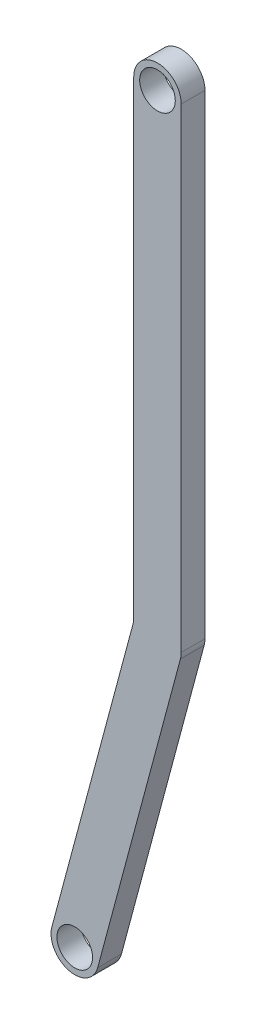
ISO-10303-21;
HEADER;
FILE_DESCRIPTION(('STEP AP214'),'2;1');
FILE_NAME('part.step','',(''),(''),'','','');
FILE_SCHEMA(('AUTOMOTIVE_DESIGN { 1 0 10303 214 1 1 1 1 }'));
ENDSEC;
DATA;
#1=APPLICATION_CONTEXT('core data for automotive mechanical design processes');
#2=APPLICATION_PROTOCOL_DEFINITION('international standard','automotive_design',2000,#1);
#3=PRODUCT_CONTEXT('',#1,'mechanical');
#4=PRODUCT('Part','Part','',(#3));
#5=PRODUCT_RELATED_PRODUCT_CATEGORY('part','',(#4));
#6=PRODUCT_DEFINITION_FORMATION('','',#4);
#7=PRODUCT_DEFINITION_CONTEXT('part definition',#1,'design');
#8=PRODUCT_DEFINITION('design','',#6,#7);
#9=PRODUCT_DEFINITION_SHAPE('','',#8);
#10=(LENGTH_UNIT() NAMED_UNIT(*) SI_UNIT(.MILLI.,.METRE.));
#11=(NAMED_UNIT(*) PLANE_ANGLE_UNIT() SI_UNIT($,.RADIAN.));
#12=(NAMED_UNIT(*) SI_UNIT($,.STERADIAN.) SOLID_ANGLE_UNIT());
#13=UNCERTAINTY_MEASURE_WITH_UNIT(LENGTH_MEASURE(1.E-05),#10,'distance_accuracy_value','');
#14=(GEOMETRIC_REPRESENTATION_CONTEXT(3) GLOBAL_UNCERTAINTY_ASSIGNED_CONTEXT((#13)) GLOBAL_UNIT_ASSIGNED_CONTEXT((#10,
#11,#12)) REPRESENTATION_CONTEXT('',''));
#15=CARTESIAN_POINT('',(0.,0.,0.));
#16=DIRECTION('',(0.,0.,1.));
#17=DIRECTION('',(1.,0.,0.));
#18=AXIS2_PLACEMENT_3D('',#15,#16,#17);
#19=CARTESIAN_POINT('',(5.96592582628884,-1.59856500725799,1.));
#20=DIRECTION('',(0.965925826289072,-0.258819045102508,0.));
#21=DIRECTION('',(0.258819045102508,0.965925826289072,0.));
#22=AXIS2_PLACEMENT_3D('',#19,#20,#21);
#23=PLANE('',#22);
#24=DIRECTION('',(-0.258819045102508,-0.965925826289072,0.));
#25=VECTOR('',#24,1.);
#26=CARTESIAN_POINT('',(5.96592582628884,-1.59856500725799,0.));
#27=LINE('',#26,#25);
#28=CARTESIAN_POINT('',(0.965925826289076,-20.2588190451025,0.));
#29=VERTEX_POINT('',#28);
#30=CARTESIAN_POINT('',(-2.51741367531533,-33.2588190451025,0.));
#31=VERTEX_POINT('',#30);
#32=EDGE_CURVE('E131',#29,#31,#27,.T.);
#33=ORIENTED_EDGE('',*,*,#32,.F.);
#34=DIRECTION('',(0.,0.,-1.));
#35=VECTOR('',#34,1.);
#36=CARTESIAN_POINT('',(0.965925826289076,-20.2588190451025,1.));
#37=LINE('',#36,#35);
#38=CARTESIAN_POINT('',(0.965925826289076,-20.2588190451025,1.));
#39=VERTEX_POINT('',#38);
#40=EDGE_CURVE('E11',#39,#29,#37,.T.);
#41=ORIENTED_EDGE('',*,*,#40,.F.);
#42=DIRECTION('',(-0.258819045102508,-0.965925826289072,0.));
#43=VECTOR('',#42,1.);
#44=CARTESIAN_POINT('',(5.96592582628884,-1.59856500725799,1.));
#45=LINE('',#44,#43);
#46=CARTESIAN_POINT('',(-2.51741367531533,-33.2588190451025,1.));
#47=VERTEX_POINT('',#46);
#48=EDGE_CURVE('E152',#39,#47,#45,.T.);
#49=ORIENTED_EDGE('',*,*,#48,.T.);
#50=DIRECTION('',(0.,0.,-1.));
#51=VECTOR('',#50,1.);
#52=CARTESIAN_POINT('',(-2.51741367531533,-33.2588190451025,1.));
#53=LINE('',#52,#51);
#54=EDGE_CURVE('E84',#47,#31,#53,.T.);
#55=ORIENTED_EDGE('',*,*,#54,.T.);
#56=EDGE_LOOP('',(#33,#41,#49,#55));
#57=FACE_BOUND('',#56,.T.);
#58=ADVANCED_FACE('F36',(#57),#23,.T.);
#59=CARTESIAN_POINT('',(0.,-20.,1.));
#60=DIRECTION('',(0.,0.,-1.));
#61=DIRECTION('',(-1.,0.,0.));
#62=AXIS2_PLACEMENT_3D('',#59,#60,#61);
#63=CYLINDRICAL_SURFACE('',#62,1.);
#64=CARTESIAN_POINT('',(0.,-20.,0.));
#65=DIRECTION('',(0.,0.,1.));
#66=DIRECTION('',(1.,0.,0.));
#67=AXIS2_PLACEMENT_3D('',#64,#65,#66);
#68=CIRCLE('',#67,1.);
#69=CARTESIAN_POINT('',(1.,-20.,0.));
#70=VERTEX_POINT('',#69);
#71=EDGE_CURVE('E134',#29,#70,#68,.T.);
#72=ORIENTED_EDGE('',*,*,#71,.T.);
#73=DIRECTION('',(0.,0.,-1.));
#74=VECTOR('',#73,1.);
#75=CARTESIAN_POINT('',(1.,-20.,1.));
#76=LINE('',#75,#74);
#77=CARTESIAN_POINT('',(1.,-20.,1.));
#78=VERTEX_POINT('',#77);
#79=EDGE_CURVE('E44',#78,#70,#76,.T.);
#80=ORIENTED_EDGE('',*,*,#79,.F.);
#81=CARTESIAN_POINT('',(0.,-20.,1.));
#82=DIRECTION('',(0.,0.,1.));
#83=DIRECTION('',(1.,0.,0.));
#84=AXIS2_PLACEMENT_3D('',#81,#82,#83);
#85=CIRCLE('',#84,1.);
#86=EDGE_CURVE('E172',#39,#78,#85,.T.);
#87=ORIENTED_EDGE('',*,*,#86,.F.);
#88=ORIENTED_EDGE('',*,*,#40,.T.);
#89=EDGE_LOOP('',(#72,#80,#87,#88));
#90=FACE_BOUND('',#89,.T.);
#91=ADVANCED_FACE('F165',(#90),#63,.T.);
#92=CARTESIAN_POINT('',(1.,0.,1.));
#93=DIRECTION('',(1.,0.,0.));
#94=DIRECTION('',(0.,1.,0.));
#95=AXIS2_PLACEMENT_3D('',#92,#93,#94);
#96=PLANE('',#95);
#97=DIRECTION('',(0.,-1.,0.));
#98=VECTOR('',#97,1.);
#99=CARTESIAN_POINT('',(1.,0.,0.));
#100=LINE('',#99,#98);
#101=CARTESIAN_POINT('',(1.,0.,0.));
#102=VERTEX_POINT('',#101);
#103=EDGE_CURVE('E137',#102,#70,#100,.T.);
#104=ORIENTED_EDGE('',*,*,#103,.F.);
#105=DIRECTION('',(0.,0.,-1.));
#106=VECTOR('',#105,1.);
#107=CARTESIAN_POINT('',(1.,0.,1.));
#108=LINE('',#107,#106);
#109=CARTESIAN_POINT('',(1.,0.,1.));
#110=VERTEX_POINT('',#109);
#111=EDGE_CURVE('E156',#110,#102,#108,.T.);
#112=ORIENTED_EDGE('',*,*,#111,.F.);
#113=DIRECTION('',(0.,-1.,0.));
#114=VECTOR('',#113,1.);
#115=CARTESIAN_POINT('',(1.,0.,1.));
#116=LINE('',#115,#114);
#117=EDGE_CURVE('E162',#110,#78,#116,.T.);
#118=ORIENTED_EDGE('',*,*,#117,.T.);
#119=ORIENTED_EDGE('',*,*,#79,.T.);
#120=EDGE_LOOP('',(#104,#112,#118,#119));
#121=FACE_BOUND('',#120,.T.);
#122=ADVANCED_FACE('F161',(#121),#96,.T.);
#123=CARTESIAN_POINT('',(0.,0.,1.));
#124=DIRECTION('',(0.,0.,-1.));
#125=DIRECTION('',(-1.,0.,0.));
#126=AXIS2_PLACEMENT_3D('',#123,#124,#125);
#127=CYLINDRICAL_SURFACE('',#126,1.);
#128=CARTESIAN_POINT('',(0.,0.,0.));
#129=DIRECTION('',(0.,0.,1.));
#130=DIRECTION('',(1.,0.,0.));
#131=AXIS2_PLACEMENT_3D('',#128,#129,#130);
#132=CIRCLE('',#131,1.);
#133=CARTESIAN_POINT('',(-1.,0.,0.));
#134=VERTEX_POINT('',#133);
#135=EDGE_CURVE('E140',#102,#134,#132,.T.);
#136=ORIENTED_EDGE('',*,*,#135,.T.);
#137=DIRECTION('',(0.,0.,-1.));
#138=VECTOR('',#137,1.);
#139=CARTESIAN_POINT('',(-1.,0.,1.));
#140=LINE('',#139,#138);
#141=CARTESIAN_POINT('',(-1.,0.,1.));
#142=VERTEX_POINT('',#141);
#143=EDGE_CURVE('E117',#142,#134,#140,.T.);
#144=ORIENTED_EDGE('',*,*,#143,.F.);
#145=CARTESIAN_POINT('',(0.,0.,1.));
#146=DIRECTION('',(0.,0.,1.));
#147=DIRECTION('',(1.,0.,0.));
#148=AXIS2_PLACEMENT_3D('',#145,#146,#147);
#149=CIRCLE('',#148,1.);
#150=EDGE_CURVE('E108',#110,#142,#149,.T.);
#151=ORIENTED_EDGE('',*,*,#150,.F.);
#152=ORIENTED_EDGE('',*,*,#111,.T.);
#153=EDGE_LOOP('',(#136,#144,#151,#152));
#154=FACE_BOUND('',#153,.T.);
#155=ADVANCED_FACE('F171',(#154),#127,.T.);
#156=CARTESIAN_POINT('',(-1.,0.,1.));
#157=DIRECTION('',(1.,0.,0.));
#158=DIRECTION('',(0.,1.,0.));
#159=AXIS2_PLACEMENT_3D('',#156,#157,#158);
#160=PLANE('',#159);
#161=DIRECTION('',(0.,-1.,0.));
#162=VECTOR('',#161,1.);
#163=CARTESIAN_POINT('',(-1.,0.,0.));
#164=LINE('',#163,#162);
#165=CARTESIAN_POINT('',(-0.999999999999998,-19.8683475024126,0.));
#166=VERTEX_POINT('',#165);
#167=EDGE_CURVE('E116',#134,#166,#164,.T.);
#168=ORIENTED_EDGE('',*,*,#167,.T.);
#169=DIRECTION('',(0.,0.,-1.));
#170=VECTOR('',#169,1.);
#171=CARTESIAN_POINT('',(-0.999999999999998,-19.8683475024126,1.));
#172=LINE('',#171,#170);
#173=CARTESIAN_POINT('',(-0.999999999999998,-19.8683475024126,1.));
#174=VERTEX_POINT('',#173);
#175=EDGE_CURVE('E113',#174,#166,#172,.T.);
#176=ORIENTED_EDGE('',*,*,#175,.F.);
#177=DIRECTION('',(0.,-1.,0.));
#178=VECTOR('',#177,1.);
#179=CARTESIAN_POINT('',(-1.,0.,1.));
#180=LINE('',#179,#178);
#181=EDGE_CURVE('E100',#142,#174,#180,.T.);
#182=ORIENTED_EDGE('',*,*,#181,.F.);
#183=ORIENTED_EDGE('',*,*,#143,.T.);
#184=EDGE_LOOP('',(#168,#176,#182,#183));
#185=FACE_BOUND('',#184,.T.);
#186=ADVANCED_FACE('F114',(#185),#160,.F.);
#187=CARTESIAN_POINT('',(4.03407417371069,-1.08092691705297,1.));
#188=DIRECTION('',(0.965925826289072,-0.258819045102507,0.));
#189=DIRECTION('',(0.258819045102507,0.965925826289072,0.));
#190=AXIS2_PLACEMENT_3D('',#187,#188,#189);
#191=PLANE('',#190);
#192=DIRECTION('',(-0.258819045102507,-0.965925826289072,0.));
#193=VECTOR('',#192,1.);
#194=CARTESIAN_POINT('',(4.03407417371069,-1.08092691705297,0.));
#195=LINE('',#194,#193);
#196=CARTESIAN_POINT('',(-4.44926532789347,-32.7411809548975,0.));
#197=VERTEX_POINT('',#196);
#198=EDGE_CURVE('E77',#166,#197,#195,.T.);
#199=ORIENTED_EDGE('',*,*,#198,.T.);
#200=DIRECTION('',(0.,0.,-1.));
#201=VECTOR('',#200,1.);
#202=CARTESIAN_POINT('',(-4.44926532789347,-32.7411809548975,1.));
#203=LINE('',#202,#201);
#204=CARTESIAN_POINT('',(-4.44926532789347,-32.7411809548975,1.));
#205=VERTEX_POINT('',#204);
#206=EDGE_CURVE('E118',#205,#197,#203,.T.);
#207=ORIENTED_EDGE('',*,*,#206,.F.);
#208=DIRECTION('',(-0.258819045102507,-0.965925826289072,0.));
#209=VECTOR('',#208,1.);
#210=CARTESIAN_POINT('',(4.03407417371069,-1.08092691705297,1.));
#211=LINE('',#210,#209);
#212=EDGE_CURVE('E105',#174,#205,#211,.T.);
#213=ORIENTED_EDGE('',*,*,#212,.F.);
#214=ORIENTED_EDGE('',*,*,#175,.T.);
#215=EDGE_LOOP('',(#199,#207,#213,#214));
#216=FACE_BOUND('',#215,.T.);
#217=ADVANCED_FACE('F120',(#216),#191,.F.);
#218=CARTESIAN_POINT('',(-3.4833395016044,-33.,1.));
#219=DIRECTION('',(0.,0.,-1.));
#220=DIRECTION('',(-1.,0.,0.));
#221=AXIS2_PLACEMENT_3D('',#218,#219,#220);
#222=CYLINDRICAL_SURFACE('',#221,0.750000000000001);
#223=CARTESIAN_POINT('',(-3.4833395016044,-33.,1.));
#224=DIRECTION('',(0.,0.,1.));
#225=DIRECTION('',(1.,0.,0.));
#226=AXIS2_PLACEMENT_3D('',#223,#224,#225);
#227=CIRCLE('',#226,0.750000000000001);
#228=CARTESIAN_POINT('',(-2.7333395016044,-33.,1.));
#229=VERTEX_POINT('',#228);
#230=EDGE_CURVE('E122',#229,#229,#227,.T.);
#231=ORIENTED_EDGE('',*,*,#230,.T.);
#232=EDGE_LOOP('',(#231));
#233=FACE_BOUND('',#232,.T.);
#234=CARTESIAN_POINT('',(-3.4833395016044,-33.,0.));
#235=DIRECTION('',(0.,0.,1.));
#236=DIRECTION('',(1.,0.,0.));
#237=AXIS2_PLACEMENT_3D('',#234,#235,#236);
#238=CIRCLE('',#237,0.750000000000001);
#239=CARTESIAN_POINT('',(-2.7333395016044,-33.,0.));
#240=VERTEX_POINT('',#239);
#241=EDGE_CURVE('E146',#240,#240,#238,.T.);
#242=ORIENTED_EDGE('',*,*,#241,.F.);
#243=EDGE_LOOP('',(#242));
#244=FACE_BOUND('',#243,.T.);
#245=ADVANCED_FACE('F191',(#233,#244),#222,.F.);
#246=CARTESIAN_POINT('',(-3.4833395016044,-33.,1.));
#247=DIRECTION('',(0.,0.,-1.));
#248=DIRECTION('',(-1.,0.,0.));
#249=AXIS2_PLACEMENT_3D('',#246,#247,#248);
#250=CYLINDRICAL_SURFACE('',#249,0.999999999999998);
#251=CARTESIAN_POINT('',(-3.4833395016044,-33.,0.));
#252=DIRECTION('',(0.,0.,1.));
#253=DIRECTION('',(1.,0.,0.));
#254=AXIS2_PLACEMENT_3D('',#251,#252,#253);
#255=CIRCLE('',#254,0.999999999999998);
#256=EDGE_CURVE('E144',#197,#31,#255,.T.);
#257=ORIENTED_EDGE('',*,*,#256,.T.);
#258=ORIENTED_EDGE('',*,*,#54,.F.);
#259=CARTESIAN_POINT('',(-3.4833395016044,-33.,1.));
#260=DIRECTION('',(0.,0.,1.));
#261=DIRECTION('',(1.,0.,0.));
#262=AXIS2_PLACEMENT_3D('',#259,#260,#261);
#263=CIRCLE('',#262,0.999999999999998);
#264=EDGE_CURVE('E52',#205,#47,#263,.T.);
#265=ORIENTED_EDGE('',*,*,#264,.F.);
#266=ORIENTED_EDGE('',*,*,#206,.T.);
#267=EDGE_LOOP('',(#257,#258,#265,#266));
#268=FACE_BOUND('',#267,.T.);
#269=ADVANCED_FACE('F192',(#268),#250,.T.);
#270=CARTESIAN_POINT('',(0.,0.,1.));
#271=DIRECTION('',(0.,0.,-1.));
#272=DIRECTION('',(-1.,0.,0.));
#273=AXIS2_PLACEMENT_3D('',#270,#271,#272);
#274=CYLINDRICAL_SURFACE('',#273,0.75);
#275=CARTESIAN_POINT('',(0.,0.,1.));
#276=DIRECTION('',(0.,0.,1.));
#277=DIRECTION('',(1.,0.,0.));
#278=AXIS2_PLACEMENT_3D('',#275,#276,#277);
#279=CIRCLE('',#278,0.75);
#280=CARTESIAN_POINT('',(0.75,0.,1.));
#281=VERTEX_POINT('',#280);
#282=EDGE_CURVE('E128',#281,#281,#279,.T.);
#283=ORIENTED_EDGE('',*,*,#282,.T.);
#284=EDGE_LOOP('',(#283));
#285=FACE_BOUND('',#284,.T.);
#286=CARTESIAN_POINT('',(0.,0.,0.));
#287=DIRECTION('',(0.,0.,1.));
#288=DIRECTION('',(1.,0.,0.));
#289=AXIS2_PLACEMENT_3D('',#286,#287,#288);
#290=CIRCLE('',#289,0.75);
#291=CARTESIAN_POINT('',(0.75,0.,0.));
#292=VERTEX_POINT('',#291);
#293=EDGE_CURVE('E149',#292,#292,#290,.T.);
#294=ORIENTED_EDGE('',*,*,#293,.F.);
#295=EDGE_LOOP('',(#294));
#296=FACE_BOUND('',#295,.T.);
#297=ADVANCED_FACE('F195',(#285,#296),#274,.F.);
#298=CARTESIAN_POINT('',(0.,0.,1.));
#299=DIRECTION('',(0.,0.,1.));
#300=DIRECTION('',(1.,0.,0.));
#301=AXIS2_PLACEMENT_3D('',#298,#299,#300);
#302=PLANE('',#301);
#303=ORIENTED_EDGE('',*,*,#48,.F.);
#304=ORIENTED_EDGE('',*,*,#86,.T.);
#305=ORIENTED_EDGE('',*,*,#117,.F.);
#306=ORIENTED_EDGE('',*,*,#150,.T.);
#307=ORIENTED_EDGE('',*,*,#181,.T.);
#308=ORIENTED_EDGE('',*,*,#212,.T.);
#309=ORIENTED_EDGE('',*,*,#264,.T.);
#310=EDGE_LOOP('',(#303,#304,#305,#306,#307,#308,#309));
#311=FACE_BOUND('',#310,.T.);
#312=ORIENTED_EDGE('',*,*,#230,.F.);
#313=EDGE_LOOP('',(#312));
#314=FACE_BOUND('',#313,.T.);
#315=ORIENTED_EDGE('',*,*,#282,.F.);
#316=EDGE_LOOP('',(#315));
#317=FACE_BOUND('',#316,.T.);
#318=ADVANCED_FACE('F102',(#311,#314,#317),#302,.T.);
#319=CARTESIAN_POINT('',(0.,0.,0.));
#320=DIRECTION('',(0.,0.,1.));
#321=DIRECTION('',(1.,0.,0.));
#322=AXIS2_PLACEMENT_3D('',#319,#320,#321);
#323=PLANE('',#322);
#324=ORIENTED_EDGE('',*,*,#32,.T.);
#325=ORIENTED_EDGE('',*,*,#256,.F.);
#326=ORIENTED_EDGE('',*,*,#198,.F.);
#327=ORIENTED_EDGE('',*,*,#167,.F.);
#328=ORIENTED_EDGE('',*,*,#135,.F.);
#329=ORIENTED_EDGE('',*,*,#103,.T.);
#330=ORIENTED_EDGE('',*,*,#71,.F.);
#331=EDGE_LOOP('',(#324,#325,#326,#327,#328,#329,#330));
#332=FACE_BOUND('',#331,.T.);
#333=ORIENTED_EDGE('',*,*,#241,.T.);
#334=EDGE_LOOP('',(#333));
#335=FACE_BOUND('',#334,.T.);
#336=ORIENTED_EDGE('',*,*,#293,.T.);
#337=EDGE_LOOP('',(#336));
#338=FACE_BOUND('',#337,.T.);
#339=ADVANCED_FACE('F168',(#332,#335,#338),#323,.F.);
#340=CLOSED_SHELL('',(#58,#91,#122,#155,#186,#217,#245,#269,#297,#318,#339));
#341=MANIFOLD_SOLID_BREP('B2',#340);
#342=ADVANCED_BREP_SHAPE_REPRESENTATION('',(#18,#341),#14);
#343=SHAPE_DEFINITION_REPRESENTATION(#9,#342);
ENDSEC;
END-ISO-10303-21;
